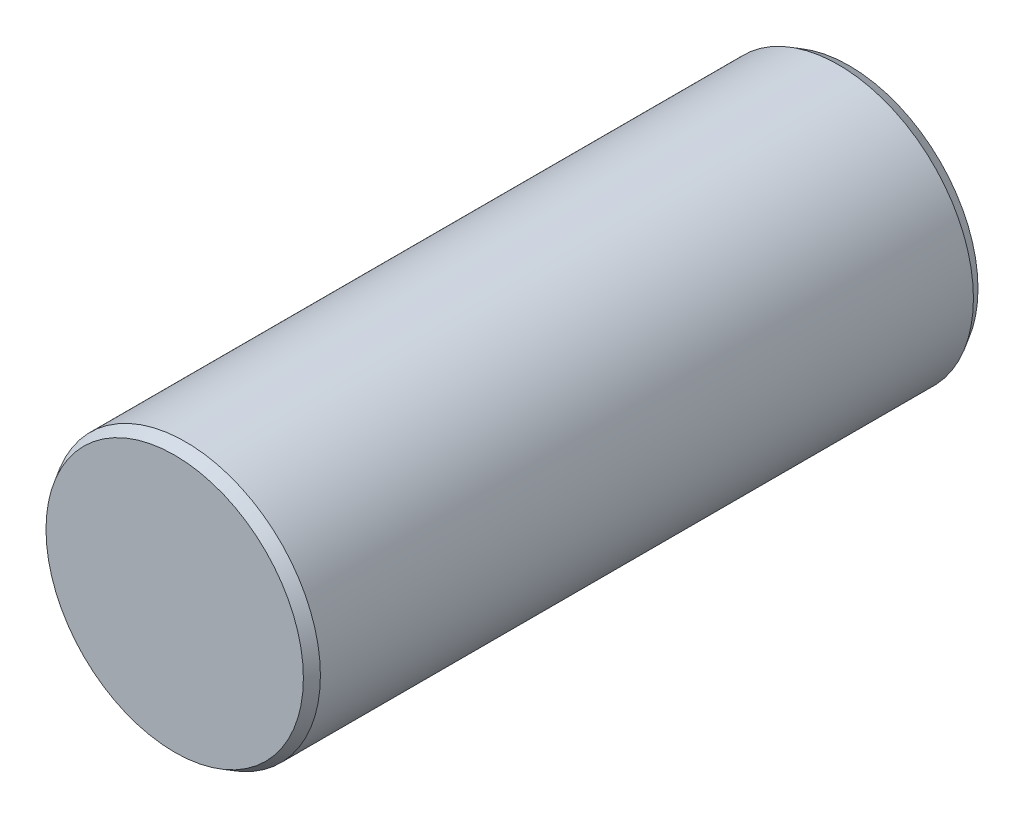
ISO-10303-21;
HEADER;
FILE_DESCRIPTION(('STEP AP214'),'2;1');
FILE_NAME('part.step','',(''),(''),'','','');
FILE_SCHEMA(('AUTOMOTIVE_DESIGN { 1 0 10303 214 1 1 1 1 }'));
ENDSEC;
DATA;
#1=APPLICATION_CONTEXT('core data for automotive mechanical design processes');
#2=APPLICATION_PROTOCOL_DEFINITION('international standard','automotive_design',2000,#1);
#3=PRODUCT_CONTEXT('',#1,'mechanical');
#4=PRODUCT('Part','Part','',(#3));
#5=PRODUCT_RELATED_PRODUCT_CATEGORY('part','',(#4));
#6=PRODUCT_DEFINITION_FORMATION('','',#4);
#7=PRODUCT_DEFINITION_CONTEXT('part definition',#1,'design');
#8=PRODUCT_DEFINITION('design','',#6,#7);
#9=PRODUCT_DEFINITION_SHAPE('','',#8);
#10=(LENGTH_UNIT() NAMED_UNIT(*) SI_UNIT(.MILLI.,.METRE.));
#11=(NAMED_UNIT(*) PLANE_ANGLE_UNIT() SI_UNIT($,.RADIAN.));
#12=(NAMED_UNIT(*) SI_UNIT($,.STERADIAN.) SOLID_ANGLE_UNIT());
#13=UNCERTAINTY_MEASURE_WITH_UNIT(LENGTH_MEASURE(1.E-05),#10,'distance_accuracy_value','');
#14=(GEOMETRIC_REPRESENTATION_CONTEXT(3) GLOBAL_UNCERTAINTY_ASSIGNED_CONTEXT((#13)) GLOBAL_UNIT_ASSIGNED_CONTEXT((#10,
#11,#12)) REPRESENTATION_CONTEXT('',''));
#15=CARTESIAN_POINT('',(0.,0.,0.));
#16=DIRECTION('',(0.,0.,1.));
#17=DIRECTION('',(1.,0.,0.));
#18=AXIS2_PLACEMENT_3D('',#15,#16,#17);
#19=CARTESIAN_POINT('',(0.,0.,6.25));
#20=DIRECTION('',(0.,0.,-1.));
#21=DIRECTION('',(-1.,0.,0.));
#22=AXIS2_PLACEMENT_3D('',#19,#20,#21);
#23=CYLINDRICAL_SURFACE('',#22,2.5);
#24=CARTESIAN_POINT('',(0.,0.,-6.05));
#25=DIRECTION('',(0.,0.,1.));
#26=DIRECTION('',(1.,0.,0.));
#27=AXIS2_PLACEMENT_3D('',#24,#25,#26);
#28=CIRCLE('',#27,2.5);
#29=CARTESIAN_POINT('',(2.5,0.,-6.05));
#30=VERTEX_POINT('',#29);
#31=EDGE_CURVE('E42',#30,#30,#28,.T.);
#32=ORIENTED_EDGE('',*,*,#31,.T.);
#33=EDGE_LOOP('',(#32));
#34=FACE_BOUND('',#33,.T.);
#35=CARTESIAN_POINT('',(0.,0.,6.05000000000001));
#36=DIRECTION('',(0.,0.,1.));
#37=DIRECTION('',(1.,0.,0.));
#38=AXIS2_PLACEMENT_3D('',#35,#36,#37);
#39=CIRCLE('',#38,2.5);
#40=CARTESIAN_POINT('',(2.5,0.,6.05000000000001));
#41=VERTEX_POINT('',#40);
#42=EDGE_CURVE('E46',#41,#41,#39,.F.);
#43=ORIENTED_EDGE('',*,*,#42,.T.);
#44=EDGE_LOOP('',(#43));
#45=FACE_BOUND('',#44,.T.);
#46=ADVANCED_FACE('F31',(#34,#45),#23,.T.);
#47=CARTESIAN_POINT('',(0.,0.,6.25));
#48=DIRECTION('',(0.,0.,1.));
#49=DIRECTION('',(1.,0.,0.));
#50=AXIS2_PLACEMENT_3D('',#47,#48,#49);
#51=PLANE('',#50);
#52=CARTESIAN_POINT('',(0.,0.,6.25));
#53=DIRECTION('',(0.,0.,1.));
#54=DIRECTION('',(1.,0.,0.));
#55=AXIS2_PLACEMENT_3D('',#52,#53,#54);
#56=CIRCLE('',#55,2.38452994616208);
#57=CARTESIAN_POINT('',(2.38452994616208,0.,6.25));
#58=VERTEX_POINT('',#57);
#59=EDGE_CURVE('E10',#58,#58,#56,.T.);
#60=ORIENTED_EDGE('',*,*,#59,.T.);
#61=EDGE_LOOP('',(#60));
#62=FACE_BOUND('',#61,.T.);
#63=ADVANCED_FACE('F62',(#62),#51,.T.);
#64=CARTESIAN_POINT('',(0.,0.,-6.25));
#65=DIRECTION('',(0.,0.,1.));
#66=DIRECTION('',(1.,0.,0.));
#67=AXIS2_PLACEMENT_3D('',#64,#65,#66);
#68=PLANE('',#67);
#69=CARTESIAN_POINT('',(0.,0.,-6.25));
#70=DIRECTION('',(0.,0.,1.));
#71=DIRECTION('',(1.,0.,0.));
#72=AXIS2_PLACEMENT_3D('',#69,#70,#71);
#73=CIRCLE('',#72,2.38452994616208);
#74=CARTESIAN_POINT('',(2.38452994616208,0.,-6.25));
#75=VERTEX_POINT('',#74);
#76=EDGE_CURVE('E38',#75,#75,#73,.F.);
#77=ORIENTED_EDGE('',*,*,#76,.T.);
#78=EDGE_LOOP('',(#77));
#79=FACE_BOUND('',#78,.T.);
#80=ADVANCED_FACE('F59',(#79),#68,.F.);
#81=CARTESIAN_POINT('',(0.,0.,-6.05));
#82=DIRECTION('',(0.,0.,1.));
#83=DIRECTION('',(1.,0.,0.));
#84=AXIS2_PLACEMENT_3D('',#81,#82,#83);
#85=CONICAL_SURFACE('',#84,2.5,0.523598775598291);
#86=ORIENTED_EDGE('',*,*,#76,.F.);
#87=EDGE_LOOP('',(#86));
#88=FACE_BOUND('',#87,.T.);
#89=ORIENTED_EDGE('',*,*,#31,.F.);
#90=EDGE_LOOP('',(#89));
#91=FACE_BOUND('',#90,.T.);
#92=ADVANCED_FACE('F55',(#88,#91),#85,.T.);
#93=CARTESIAN_POINT('',(0.,0.,6.25));
#94=DIRECTION('',(0.,0.,-1.));
#95=DIRECTION('',(-1.,0.,0.));
#96=AXIS2_PLACEMENT_3D('',#93,#94,#95);
#97=CONICAL_SURFACE('',#96,2.38452994616208,0.523598775598295);
#98=ORIENTED_EDGE('',*,*,#42,.F.);
#99=EDGE_LOOP('',(#98));
#100=FACE_BOUND('',#99,.T.);
#101=ORIENTED_EDGE('',*,*,#59,.F.);
#102=EDGE_LOOP('',(#101));
#103=FACE_BOUND('',#102,.T.);
#104=ADVANCED_FACE('F33',(#100,#103),#97,.T.);
#105=CLOSED_SHELL('',(#46,#63,#80,#92,#104));
#106=MANIFOLD_SOLID_BREP('B2',#105);
#107=ADVANCED_BREP_SHAPE_REPRESENTATION('',(#18,#106),#14);
#108=SHAPE_DEFINITION_REPRESENTATION(#9,#107);
ENDSEC;
END-ISO-10303-21;
